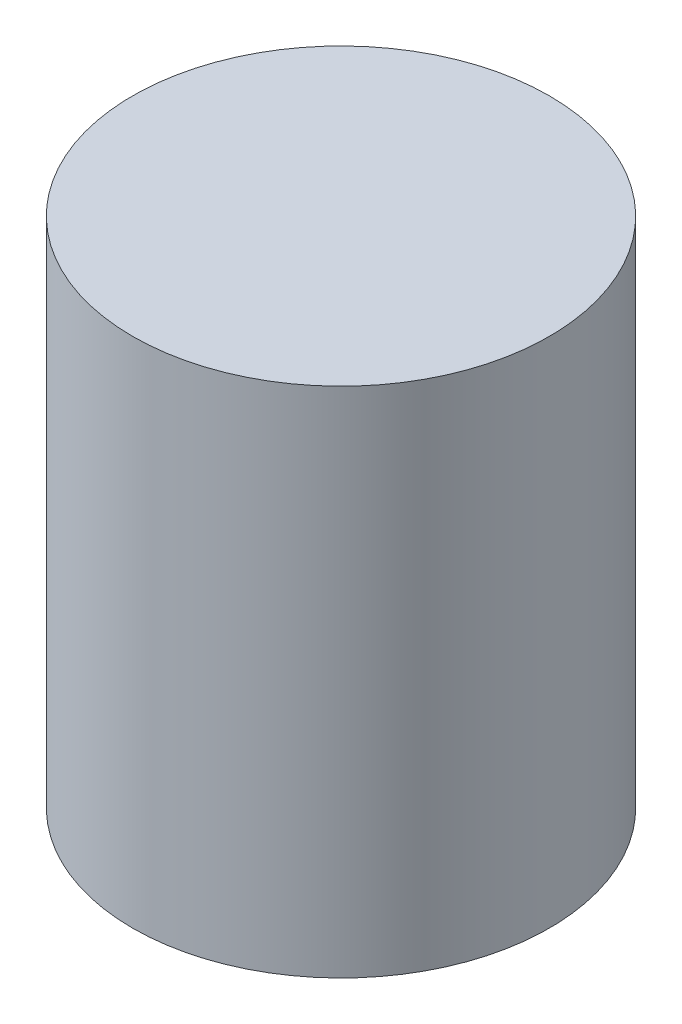
ISO-10303-21;
HEADER;
FILE_DESCRIPTION(('STEP AP214'),'2;1');
FILE_NAME('part.step','',(''),(''),'','','');
FILE_SCHEMA(('AUTOMOTIVE_DESIGN { 1 0 10303 214 1 1 1 1 }'));
ENDSEC;
DATA;
#1=APPLICATION_CONTEXT('core data for automotive mechanical design processes');
#2=APPLICATION_PROTOCOL_DEFINITION('international standard','automotive_design',2000,#1);
#3=PRODUCT_CONTEXT('',#1,'mechanical');
#4=PRODUCT('Part','Part','',(#3));
#5=PRODUCT_RELATED_PRODUCT_CATEGORY('part','',(#4));
#6=PRODUCT_DEFINITION_FORMATION('','',#4);
#7=PRODUCT_DEFINITION_CONTEXT('part definition',#1,'design');
#8=PRODUCT_DEFINITION('design','',#6,#7);
#9=PRODUCT_DEFINITION_SHAPE('','',#8);
#10=(LENGTH_UNIT() NAMED_UNIT(*) SI_UNIT(.MILLI.,.METRE.));
#11=(NAMED_UNIT(*) PLANE_ANGLE_UNIT() SI_UNIT($,.RADIAN.));
#12=(NAMED_UNIT(*) SI_UNIT($,.STERADIAN.) SOLID_ANGLE_UNIT());
#13=UNCERTAINTY_MEASURE_WITH_UNIT(LENGTH_MEASURE(1.E-05),#10,'distance_accuracy_value','');
#14=(GEOMETRIC_REPRESENTATION_CONTEXT(3) GLOBAL_UNCERTAINTY_ASSIGNED_CONTEXT((#13)) GLOBAL_UNIT_ASSIGNED_CONTEXT((#10,
#11,#12)) REPRESENTATION_CONTEXT('',''));
#15=CARTESIAN_POINT('',(0.,0.,0.));
#16=DIRECTION('',(0.,0.,1.));
#17=DIRECTION('',(1.,0.,0.));
#18=AXIS2_PLACEMENT_3D('',#15,#16,#17);
#19=CARTESIAN_POINT('',(-8.11103749520789,50.,-1.66991948430744));
#20=DIRECTION('',(0.,-1.,0.));
#21=DIRECTION('',(0.,0.,-1.));
#22=AXIS2_PLACEMENT_3D('',#19,#20,#21);
#23=CYLINDRICAL_SURFACE('',#22,20.3272718498061);
#24=CARTESIAN_POINT('',(-8.11103749520789,50.,-1.66991948430744));
#25=DIRECTION('',(0.,1.,0.));
#26=DIRECTION('',(0.,0.,1.));
#27=AXIS2_PLACEMENT_3D('',#24,#25,#26);
#28=CIRCLE('',#27,20.3272718498061);
#29=CARTESIAN_POINT('',(-8.11103749520789,50.,18.6573523654987));
#30=VERTEX_POINT('',#29);
#31=EDGE_CURVE('E10',#30,#30,#28,.T.);
#32=ORIENTED_EDGE('',*,*,#31,.F.);
#33=EDGE_LOOP('',(#32));
#34=FACE_BOUND('',#33,.T.);
#35=CARTESIAN_POINT('',(-8.11103749520789,0.,-1.66991948430744));
#36=DIRECTION('',(0.,1.,0.));
#37=DIRECTION('',(0.,0.,1.));
#38=AXIS2_PLACEMENT_3D('',#35,#36,#37);
#39=CIRCLE('',#38,20.3272718498061);
#40=CARTESIAN_POINT('',(-8.11103749520789,0.,18.6573523654987));
#41=VERTEX_POINT('',#40);
#42=EDGE_CURVE('E40',#41,#41,#39,.T.);
#43=ORIENTED_EDGE('',*,*,#42,.T.);
#44=EDGE_LOOP('',(#43));
#45=FACE_BOUND('',#44,.T.);
#46=ADVANCED_FACE('F37',(#34,#45),#23,.T.);
#47=CARTESIAN_POINT('',(-8.11103749520789,50.,-1.66991948430744));
#48=DIRECTION('',(0.,1.,0.));
#49=DIRECTION('',(0.,0.,1.));
#50=AXIS2_PLACEMENT_3D('',#47,#48,#49);
#51=PLANE('',#50);
#52=ORIENTED_EDGE('',*,*,#31,.T.);
#53=EDGE_LOOP('',(#52));
#54=FACE_BOUND('',#53,.T.);
#55=ADVANCED_FACE('F54',(#54),#51,.T.);
#56=CARTESIAN_POINT('',(-8.11103749520789,0.,-1.66991948430744));
#57=DIRECTION('',(0.,1.,0.));
#58=DIRECTION('',(0.,0.,1.));
#59=AXIS2_PLACEMENT_3D('',#56,#57,#58);
#60=PLANE('',#59);
#61=ORIENTED_EDGE('',*,*,#42,.F.);
#62=EDGE_LOOP('',(#61));
#63=FACE_BOUND('',#62,.T.);
#64=ADVANCED_FACE('F52',(#63),#60,.F.);
#65=CLOSED_SHELL('',(#46,#55,#64));
#66=MANIFOLD_SOLID_BREP('B2',#65);
#67=ADVANCED_BREP_SHAPE_REPRESENTATION('',(#18,#66),#14);
#68=SHAPE_DEFINITION_REPRESENTATION(#9,#67);
ENDSEC;
END-ISO-10303-21;
